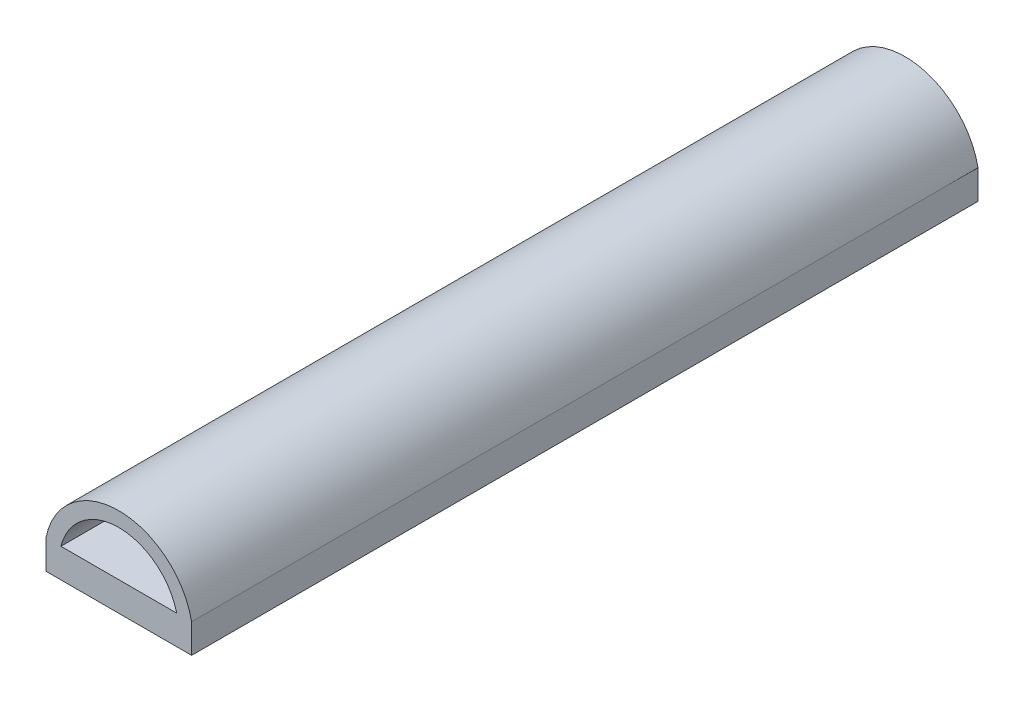
ISO-10303-21;
HEADER;
FILE_DESCRIPTION(('STEP AP214'),'2;1');
FILE_NAME('part.step','',(''),(''),'','','');
FILE_SCHEMA(('AUTOMOTIVE_DESIGN { 1 0 10303 214 1 1 1 1 }'));
ENDSEC;
DATA;
#1=APPLICATION_CONTEXT('core data for automotive mechanical design processes');
#2=APPLICATION_PROTOCOL_DEFINITION('international standard','automotive_design',2000,#1);
#3=PRODUCT_CONTEXT('',#1,'mechanical');
#4=PRODUCT('Part','Part','',(#3));
#5=PRODUCT_RELATED_PRODUCT_CATEGORY('part','',(#4));
#6=PRODUCT_DEFINITION_FORMATION('','',#4);
#7=PRODUCT_DEFINITION_CONTEXT('part definition',#1,'design');
#8=PRODUCT_DEFINITION('design','',#6,#7);
#9=PRODUCT_DEFINITION_SHAPE('','',#8);
#10=(LENGTH_UNIT() NAMED_UNIT(*) SI_UNIT(.MILLI.,.METRE.));
#11=(NAMED_UNIT(*) PLANE_ANGLE_UNIT() SI_UNIT($,.RADIAN.));
#12=(NAMED_UNIT(*) SI_UNIT($,.STERADIAN.) SOLID_ANGLE_UNIT());
#13=UNCERTAINTY_MEASURE_WITH_UNIT(LENGTH_MEASURE(1.E-05),#10,'distance_accuracy_value','');
#14=(GEOMETRIC_REPRESENTATION_CONTEXT(3) GLOBAL_UNCERTAINTY_ASSIGNED_CONTEXT((#13)) GLOBAL_UNIT_ASSIGNED_CONTEXT((#10,
#11,#12)) REPRESENTATION_CONTEXT('',''));
#15=CARTESIAN_POINT('',(0.,0.,0.));
#16=DIRECTION('',(0.,0.,1.));
#17=DIRECTION('',(1.,0.,0.));
#18=AXIS2_PLACEMENT_3D('',#15,#16,#17);
#19=CARTESIAN_POINT('',(-6.35,-1.28093723036239,68.58));
#20=DIRECTION('',(0.,1.,0.));
#21=DIRECTION('',(-1.,0.,0.));
#22=AXIS2_PLACEMENT_3D('',#19,#20,#21);
#23=PLANE('',#22);
#24=DIRECTION('',(0.,0.,-1.));
#25=VECTOR('',#24,1.);
#26=CARTESIAN_POINT('',(-0.508,-1.28093723036239,25.4));
#27=LINE('',#26,#25);
#28=CARTESIAN_POINT('',(-0.508,-1.28093723036239,25.4));
#29=VERTEX_POINT('',#28);
#30=CARTESIAN_POINT('',(-0.508,-1.28093723036239,0.));
#31=VERTEX_POINT('',#30);
#32=EDGE_CURVE('E153',#29,#31,#27,.T.);
#33=ORIENTED_EDGE('',*,*,#32,.F.);
#34=DIRECTION('',(1.,0.,0.));
#35=VECTOR('',#34,1.);
#36=CARTESIAN_POINT('',(0.508,-1.28093723036239,25.4));
#37=LINE('',#36,#35);
#38=CARTESIAN_POINT('',(0.508,-1.28093723036239,25.4));
#39=VERTEX_POINT('',#38);
#40=EDGE_CURVE('E145',#29,#39,#37,.T.);
#41=ORIENTED_EDGE('',*,*,#40,.T.);
#42=DIRECTION('',(0.,0.,-1.));
#43=VECTOR('',#42,1.);
#44=CARTESIAN_POINT('',(0.508,-1.28093723036239,25.4));
#45=LINE('',#44,#43);
#46=CARTESIAN_POINT('',(0.508,-1.28093723036239,0.));
#47=VERTEX_POINT('',#46);
#48=EDGE_CURVE('E131',#39,#47,#45,.T.);
#49=ORIENTED_EDGE('',*,*,#48,.T.);
#50=DIRECTION('',(1.,0.,0.));
#51=VECTOR('',#50,1.);
#52=CARTESIAN_POINT('',(-6.35,-1.28093723036239,0.));
#53=LINE('',#52,#51);
#54=CARTESIAN_POINT('',(6.35,-1.28093723036239,0.));
#55=VERTEX_POINT('',#54);
#56=EDGE_CURVE('E231',#47,#55,#53,.T.);
#57=ORIENTED_EDGE('',*,*,#56,.T.);
#58=DIRECTION('',(0.,0.,-1.));
#59=VECTOR('',#58,1.);
#60=CARTESIAN_POINT('',(6.35,-1.28093723036239,68.58));
#61=LINE('',#60,#59);
#62=CARTESIAN_POINT('',(6.35,-1.28093723036239,68.58));
#63=VERTEX_POINT('',#62);
#64=EDGE_CURVE('E237',#63,#55,#61,.T.);
#65=ORIENTED_EDGE('',*,*,#64,.F.);
#66=DIRECTION('',(1.,0.,0.));
#67=VECTOR('',#66,1.);
#68=CARTESIAN_POINT('',(-6.35,-1.28093723036239,68.58));
#69=LINE('',#68,#67);
#70=CARTESIAN_POINT('',(-6.35,-1.28093723036239,68.58));
#71=VERTEX_POINT('',#70);
#72=EDGE_CURVE('E222',#71,#63,#69,.T.);
#73=ORIENTED_EDGE('',*,*,#72,.F.);
#74=DIRECTION('',(0.,0.,-1.));
#75=VECTOR('',#74,1.);
#76=CARTESIAN_POINT('',(-6.35,-1.28093723036239,68.58));
#77=LINE('',#76,#75);
#78=CARTESIAN_POINT('',(-6.35,-1.28093723036239,0.));
#79=VERTEX_POINT('',#78);
#80=EDGE_CURVE('E40',#71,#79,#77,.T.);
#81=ORIENTED_EDGE('',*,*,#80,.T.);
#82=EDGE_CURVE('E232',#79,#31,#53,.T.);
#83=ORIENTED_EDGE('',*,*,#82,.T.);
#84=EDGE_LOOP('',(#33,#41,#49,#57,#65,#73,#81,#83));
#85=FACE_BOUND('',#84,.T.);
#86=ADVANCED_FACE('F32',(#85),#23,.F.);
#87=CARTESIAN_POINT('',(0.,0.,68.58));
#88=DIRECTION('',(0.,0.,-1.));
#89=DIRECTION('',(-1.,0.,0.));
#90=AXIS2_PLACEMENT_3D('',#87,#88,#89);
#91=PLANE('',#90);
#92=CARTESIAN_POINT('',(0.,0.,68.58));
#93=DIRECTION('',(0.,0.,1.));
#94=DIRECTION('',(-1.,0.,0.));
#95=AXIS2_PLACEMENT_3D('',#92,#93,#94);
#96=CIRCLE('',#95,6.47361869883356);
#97=CARTESIAN_POINT('',(6.35,1.25906276963761,68.58));
#98=VERTEX_POINT('',#97);
#99=CARTESIAN_POINT('',(-6.35,1.25906276963761,68.58));
#100=VERTEX_POINT('',#99);
#101=EDGE_CURVE('E216',#98,#100,#96,.T.);
#102=ORIENTED_EDGE('',*,*,#101,.T.);
#103=DIRECTION('',(0.,-1.,0.));
#104=VECTOR('',#103,1.);
#105=CARTESIAN_POINT('',(-6.35,1.25906276963761,68.58));
#106=LINE('',#105,#104);
#107=EDGE_CURVE('E219',#100,#71,#106,.T.);
#108=ORIENTED_EDGE('',*,*,#107,.T.);
#109=ORIENTED_EDGE('',*,*,#72,.T.);
#110=DIRECTION('',(0.,1.,0.));
#111=VECTOR('',#110,1.);
#112=CARTESIAN_POINT('',(6.35,-1.28093723036239,68.58));
#113=LINE('',#112,#111);
#114=EDGE_CURVE('E224',#63,#98,#113,.T.);
#115=ORIENTED_EDGE('',*,*,#114,.T.);
#116=EDGE_LOOP('',(#102,#108,#109,#115));
#117=FACE_BOUND('',#116,.T.);
#118=CARTESIAN_POINT('',(0.,0.,68.58));
#119=DIRECTION('',(0.,0.,1.));
#120=DIRECTION('',(-1.,0.,0.));
#121=AXIS2_PLACEMENT_3D('',#118,#119,#120);
#122=CIRCLE('',#121,5.20361869883356);
#123=CARTESIAN_POINT('',(5.04900074321274,1.25906276963761,68.58));
#124=VERTEX_POINT('',#123);
#125=CARTESIAN_POINT('',(-5.04900074321274,1.25906276963761,68.58));
#126=VERTEX_POINT('',#125);
#127=EDGE_CURVE('E202',#124,#126,#122,.T.);
#128=ORIENTED_EDGE('',*,*,#127,.F.);
#129=DIRECTION('',(1.,0.,0.));
#130=VECTOR('',#129,1.);
#131=CARTESIAN_POINT('',(-5.04900074321274,1.25906276963761,68.58));
#132=LINE('',#131,#130);
#133=EDGE_CURVE('E204',#126,#124,#132,.T.);
#134=ORIENTED_EDGE('',*,*,#133,.F.);
#135=EDGE_LOOP('',(#128,#134));
#136=FACE_BOUND('',#135,.T.);
#137=ADVANCED_FACE('F276',(#117,#136),#91,.F.);
#138=CARTESIAN_POINT('',(0.,0.,0.));
#139=DIRECTION('',(0.,0.,-1.));
#140=DIRECTION('',(-1.,0.,0.));
#141=AXIS2_PLACEMENT_3D('',#138,#139,#140);
#142=PLANE('',#141);
#143=CARTESIAN_POINT('',(0.,0.,0.));
#144=DIRECTION('',(0.,0.,1.));
#145=DIRECTION('',(-1.,0.,0.));
#146=AXIS2_PLACEMENT_3D('',#143,#144,#145);
#147=CIRCLE('',#146,6.47361869883356);
#148=CARTESIAN_POINT('',(6.35,1.25906276963761,0.));
#149=VERTEX_POINT('',#148);
#150=CARTESIAN_POINT('',(-6.35,1.25906276963761,0.));
#151=VERTEX_POINT('',#150);
#152=EDGE_CURVE('E215',#149,#151,#147,.T.);
#153=ORIENTED_EDGE('',*,*,#152,.F.);
#154=DIRECTION('',(0.,1.,0.));
#155=VECTOR('',#154,1.);
#156=CARTESIAN_POINT('',(6.35,-1.28093723036239,0.));
#157=LINE('',#156,#155);
#158=EDGE_CURVE('E220',#55,#149,#157,.T.);
#159=ORIENTED_EDGE('',*,*,#158,.F.);
#160=ORIENTED_EDGE('',*,*,#56,.F.);
#161=DIRECTION('',(0.,-1.,0.));
#162=VECTOR('',#161,1.);
#163=CARTESIAN_POINT('',(0.508,-3.37643723036239,0.));
#164=LINE('',#163,#162);
#165=CARTESIAN_POINT('',(0.508,-3.37643723036239,0.));
#166=VERTEX_POINT('',#165);
#167=EDGE_CURVE('E47',#47,#166,#164,.T.);
#168=ORIENTED_EDGE('',*,*,#167,.T.);
#169=DIRECTION('',(1.,0.,0.));
#170=VECTOR('',#169,1.);
#171=CARTESIAN_POINT('',(1.0795,-3.37643723036239,0.));
#172=LINE('',#171,#170);
#173=CARTESIAN_POINT('',(1.0795,-3.37643723036239,0.));
#174=VERTEX_POINT('',#173);
#175=EDGE_CURVE('E175',#166,#174,#172,.T.);
#176=ORIENTED_EDGE('',*,*,#175,.T.);
#177=DIRECTION('',(0.,-1.,0.));
#178=VECTOR('',#177,1.);
#179=CARTESIAN_POINT('',(1.0795,-4.26543723036239,0.));
#180=LINE('',#179,#178);
#181=CARTESIAN_POINT('',(1.0795,-4.26543723036239,0.));
#182=VERTEX_POINT('',#181);
#183=EDGE_CURVE('E178',#174,#182,#180,.T.);
#184=ORIENTED_EDGE('',*,*,#183,.T.);
#185=DIRECTION('',(-1.,0.,0.));
#186=VECTOR('',#185,1.);
#187=CARTESIAN_POINT('',(-1.0795,-4.26543723036239,0.));
#188=LINE('',#187,#186);
#189=CARTESIAN_POINT('',(-1.0795,-4.26543723036239,0.));
#190=VERTEX_POINT('',#189);
#191=EDGE_CURVE('E181',#182,#190,#188,.T.);
#192=ORIENTED_EDGE('',*,*,#191,.T.);
#193=DIRECTION('',(0.,1.,0.));
#194=VECTOR('',#193,1.);
#195=CARTESIAN_POINT('',(-1.0795,-3.37643723036239,0.));
#196=LINE('',#195,#194);
#197=CARTESIAN_POINT('',(-1.0795,-3.37643723036239,0.));
#198=VERTEX_POINT('',#197);
#199=EDGE_CURVE('E184',#190,#198,#196,.T.);
#200=ORIENTED_EDGE('',*,*,#199,.T.);
#201=DIRECTION('',(1.,0.,0.));
#202=VECTOR('',#201,1.);
#203=CARTESIAN_POINT('',(-0.508,-3.37643723036239,0.));
#204=LINE('',#203,#202);
#205=CARTESIAN_POINT('',(-0.508,-3.37643723036239,0.));
#206=VERTEX_POINT('',#205);
#207=EDGE_CURVE('E157',#198,#206,#204,.T.);
#208=ORIENTED_EDGE('',*,*,#207,.T.);
#209=DIRECTION('',(0.,1.,0.));
#210=VECTOR('',#209,1.);
#211=CARTESIAN_POINT('',(-0.508,-1.28093723036239,0.));
#212=LINE('',#211,#210);
#213=EDGE_CURVE('E154',#206,#31,#212,.T.);
#214=ORIENTED_EDGE('',*,*,#213,.T.);
#215=ORIENTED_EDGE('',*,*,#82,.F.);
#216=DIRECTION('',(0.,-1.,0.));
#217=VECTOR('',#216,1.);
#218=CARTESIAN_POINT('',(-6.35,1.25906276963761,0.));
#219=LINE('',#218,#217);
#220=EDGE_CURVE('E229',#151,#79,#219,.T.);
#221=ORIENTED_EDGE('',*,*,#220,.F.);
#222=EDGE_LOOP('',(#153,#159,#160,#168,#176,#184,#192,#200,#208,#214,#215,#221));
#223=FACE_BOUND('',#222,.T.);
#224=DIRECTION('',(1.,0.,0.));
#225=VECTOR('',#224,1.);
#226=CARTESIAN_POINT('',(-5.04900074321274,1.25906276963761,0.));
#227=LINE('',#226,#225);
#228=CARTESIAN_POINT('',(-5.04900074321274,1.25906276963761,0.));
#229=VERTEX_POINT('',#228);
#230=CARTESIAN_POINT('',(5.04900074321274,1.25906276963761,0.));
#231=VERTEX_POINT('',#230);
#232=EDGE_CURVE('E205',#229,#231,#227,.T.);
#233=ORIENTED_EDGE('',*,*,#232,.T.);
#234=CARTESIAN_POINT('',(0.,0.,0.));
#235=DIRECTION('',(0.,0.,1.));
#236=DIRECTION('',(-1.,0.,0.));
#237=AXIS2_PLACEMENT_3D('',#234,#235,#236);
#238=CIRCLE('',#237,5.20361869883356);
#239=EDGE_CURVE('E190',#231,#229,#238,.T.);
#240=ORIENTED_EDGE('',*,*,#239,.T.);
#241=EDGE_LOOP('',(#233,#240));
#242=FACE_BOUND('',#241,.T.);
#243=ADVANCED_FACE('F247',(#223,#242),#142,.T.);
#244=CARTESIAN_POINT('',(0.,0.,68.58));
#245=DIRECTION('',(0.,0.,-1.));
#246=DIRECTION('',(-1.,0.,0.));
#247=AXIS2_PLACEMENT_3D('',#244,#245,#246);
#248=CYLINDRICAL_SURFACE('',#247,6.47361869883356);
#249=ORIENTED_EDGE('',*,*,#152,.T.);
#250=DIRECTION('',(0.,0.,-1.));
#251=VECTOR('',#250,1.);
#252=CARTESIAN_POINT('',(-6.35,1.25906276963761,68.58));
#253=LINE('',#252,#251);
#254=EDGE_CURVE('E11',#100,#151,#253,.T.);
#255=ORIENTED_EDGE('',*,*,#254,.F.);
#256=ORIENTED_EDGE('',*,*,#101,.F.);
#257=DIRECTION('',(0.,0.,-1.));
#258=VECTOR('',#257,1.);
#259=CARTESIAN_POINT('',(6.35,1.25906276963761,68.58));
#260=LINE('',#259,#258);
#261=EDGE_CURVE('E226',#98,#149,#260,.T.);
#262=ORIENTED_EDGE('',*,*,#261,.T.);
#263=EDGE_LOOP('',(#249,#255,#256,#262));
#264=FACE_BOUND('',#263,.T.);
#265=ADVANCED_FACE('F34',(#264),#248,.T.);
#266=CARTESIAN_POINT('',(-6.35,1.25906276963761,68.58));
#267=DIRECTION('',(1.,0.,0.));
#268=DIRECTION('',(0.,0.,-1.));
#269=AXIS2_PLACEMENT_3D('',#266,#267,#268);
#270=PLANE('',#269);
#271=ORIENTED_EDGE('',*,*,#220,.T.);
#272=ORIENTED_EDGE('',*,*,#80,.F.);
#273=ORIENTED_EDGE('',*,*,#107,.F.);
#274=ORIENTED_EDGE('',*,*,#254,.T.);
#275=EDGE_LOOP('',(#271,#272,#273,#274));
#276=FACE_BOUND('',#275,.T.);
#277=ADVANCED_FACE('F279',(#276),#270,.F.);
#278=CARTESIAN_POINT('',(6.35,-1.28093723036239,68.58));
#279=DIRECTION('',(-1.,0.,0.));
#280=DIRECTION('',(0.,0.,1.));
#281=AXIS2_PLACEMENT_3D('',#278,#279,#280);
#282=PLANE('',#281);
#283=ORIENTED_EDGE('',*,*,#158,.T.);
#284=ORIENTED_EDGE('',*,*,#261,.F.);
#285=ORIENTED_EDGE('',*,*,#114,.F.);
#286=ORIENTED_EDGE('',*,*,#64,.T.);
#287=EDGE_LOOP('',(#283,#284,#285,#286));
#288=FACE_BOUND('',#287,.T.);
#289=ADVANCED_FACE('F272',(#288),#282,.F.);
#290=CARTESIAN_POINT('',(0.,0.,68.58));
#291=DIRECTION('',(0.,0.,-1.));
#292=DIRECTION('',(-1.,0.,0.));
#293=AXIS2_PLACEMENT_3D('',#290,#291,#292);
#294=CYLINDRICAL_SURFACE('',#293,5.20361869883356);
#295=ORIENTED_EDGE('',*,*,#239,.F.);
#296=DIRECTION('',(0.,0.,-1.));
#297=VECTOR('',#296,1.);
#298=CARTESIAN_POINT('',(5.04900074321274,1.25906276963761,68.58));
#299=LINE('',#298,#297);
#300=EDGE_CURVE('E207',#124,#231,#299,.T.);
#301=ORIENTED_EDGE('',*,*,#300,.F.);
#302=ORIENTED_EDGE('',*,*,#127,.T.);
#303=DIRECTION('',(0.,0.,-1.));
#304=VECTOR('',#303,1.);
#305=CARTESIAN_POINT('',(-5.04900074321274,1.25906276963761,68.58));
#306=LINE('',#305,#304);
#307=EDGE_CURVE('E55',#126,#229,#306,.T.);
#308=ORIENTED_EDGE('',*,*,#307,.T.);
#309=EDGE_LOOP('',(#295,#301,#302,#308));
#310=FACE_BOUND('',#309,.T.);
#311=ADVANCED_FACE('F295',(#310),#294,.F.);
#312=CARTESIAN_POINT('',(-5.04900074321274,1.25906276963761,68.58));
#313=DIRECTION('',(0.,1.,0.));
#314=DIRECTION('',(0.,0.,1.));
#315=AXIS2_PLACEMENT_3D('',#312,#313,#314);
#316=PLANE('',#315);
#317=ORIENTED_EDGE('',*,*,#232,.F.);
#318=ORIENTED_EDGE('',*,*,#307,.F.);
#319=ORIENTED_EDGE('',*,*,#133,.T.);
#320=ORIENTED_EDGE('',*,*,#300,.T.);
#321=EDGE_LOOP('',(#317,#318,#319,#320));
#322=FACE_BOUND('',#321,.T.);
#323=ADVANCED_FACE('F299',(#322),#316,.T.);
#324=CARTESIAN_POINT('',(-0.508,-1.28093723036239,25.4));
#325=DIRECTION('',(-1.,0.,0.));
#326=DIRECTION('',(0.,-1.,0.));
#327=AXIS2_PLACEMENT_3D('',#324,#325,#326);
#328=PLANE('',#327);
#329=ORIENTED_EDGE('',*,*,#213,.F.);
#330=DIRECTION('',(0.,0.,-1.));
#331=VECTOR('',#330,1.);
#332=CARTESIAN_POINT('',(-0.508,-3.37643723036239,25.4));
#333=LINE('',#332,#331);
#334=CARTESIAN_POINT('',(-0.508,-3.37643723036239,25.4));
#335=VERTEX_POINT('',#334);
#336=EDGE_CURVE('E191',#335,#206,#333,.T.);
#337=ORIENTED_EDGE('',*,*,#336,.F.);
#338=DIRECTION('',(0.,1.,0.));
#339=VECTOR('',#338,1.);
#340=CARTESIAN_POINT('',(-0.508,-1.28093723036239,25.4));
#341=LINE('',#340,#339);
#342=EDGE_CURVE('E139',#335,#29,#341,.T.);
#343=ORIENTED_EDGE('',*,*,#342,.T.);
#344=ORIENTED_EDGE('',*,*,#32,.T.);
#345=EDGE_LOOP('',(#329,#337,#343,#344));
#346=FACE_BOUND('',#345,.T.);
#347=ADVANCED_FACE('F252',(#346),#328,.T.);
#348=CARTESIAN_POINT('',(-0.508,-3.37643723036239,25.4));
#349=DIRECTION('',(0.,1.,0.));
#350=DIRECTION('',(0.,0.,1.));
#351=AXIS2_PLACEMENT_3D('',#348,#349,#350);
#352=PLANE('',#351);
#353=ORIENTED_EDGE('',*,*,#207,.F.);
#354=DIRECTION('',(0.,0.,-1.));
#355=VECTOR('',#354,1.);
#356=CARTESIAN_POINT('',(-1.0795,-3.37643723036239,25.4));
#357=LINE('',#356,#355);
#358=CARTESIAN_POINT('',(-1.0795,-3.37643723036239,25.4));
#359=VERTEX_POINT('',#358);
#360=EDGE_CURVE('E193',#359,#198,#357,.T.);
#361=ORIENTED_EDGE('',*,*,#360,.F.);
#362=DIRECTION('',(1.,0.,0.));
#363=VECTOR('',#362,1.);
#364=CARTESIAN_POINT('',(-0.508,-3.37643723036239,25.4));
#365=LINE('',#364,#363);
#366=EDGE_CURVE('E170',#359,#335,#365,.T.);
#367=ORIENTED_EDGE('',*,*,#366,.T.);
#368=ORIENTED_EDGE('',*,*,#336,.T.);
#369=EDGE_LOOP('',(#353,#361,#367,#368));
#370=FACE_BOUND('',#369,.T.);
#371=ADVANCED_FACE('F313',(#370),#352,.T.);
#372=CARTESIAN_POINT('',(-1.0795,-3.37643723036239,25.4));
#373=DIRECTION('',(-1.,0.,0.));
#374=DIRECTION('',(0.,-1.,0.));
#375=AXIS2_PLACEMENT_3D('',#372,#373,#374);
#376=PLANE('',#375);
#377=ORIENTED_EDGE('',*,*,#199,.F.);
#378=DIRECTION('',(0.,0.,-1.));
#379=VECTOR('',#378,1.);
#380=CARTESIAN_POINT('',(-1.0795,-4.26543723036239,25.4));
#381=LINE('',#380,#379);
#382=CARTESIAN_POINT('',(-1.0795,-4.26543723036239,25.4));
#383=VERTEX_POINT('',#382);
#384=EDGE_CURVE('E195',#383,#190,#381,.T.);
#385=ORIENTED_EDGE('',*,*,#384,.F.);
#386=DIRECTION('',(0.,1.,0.));
#387=VECTOR('',#386,1.);
#388=CARTESIAN_POINT('',(-1.0795,-3.37643723036239,25.4));
#389=LINE('',#388,#387);
#390=EDGE_CURVE('E167',#383,#359,#389,.T.);
#391=ORIENTED_EDGE('',*,*,#390,.T.);
#392=ORIENTED_EDGE('',*,*,#360,.T.);
#393=EDGE_LOOP('',(#377,#385,#391,#392));
#394=FACE_BOUND('',#393,.T.);
#395=ADVANCED_FACE('F259',(#394),#376,.T.);
#396=CARTESIAN_POINT('',(-1.0795,-4.26543723036239,25.4));
#397=DIRECTION('',(0.,-1.,0.));
#398=DIRECTION('',(0.,0.,-1.));
#399=AXIS2_PLACEMENT_3D('',#396,#397,#398);
#400=PLANE('',#399);
#401=ORIENTED_EDGE('',*,*,#191,.F.);
#402=DIRECTION('',(0.,0.,-1.));
#403=VECTOR('',#402,1.);
#404=CARTESIAN_POINT('',(1.0795,-4.26543723036239,25.4));
#405=LINE('',#404,#403);
#406=CARTESIAN_POINT('',(1.0795,-4.26543723036239,25.4));
#407=VERTEX_POINT('',#406);
#408=EDGE_CURVE('E197',#407,#182,#405,.T.);
#409=ORIENTED_EDGE('',*,*,#408,.F.);
#410=DIRECTION('',(-1.,0.,0.));
#411=VECTOR('',#410,1.);
#412=CARTESIAN_POINT('',(-1.0795,-4.26543723036239,25.4));
#413=LINE('',#412,#411);
#414=EDGE_CURVE('E164',#407,#383,#413,.T.);
#415=ORIENTED_EDGE('',*,*,#414,.T.);
#416=ORIENTED_EDGE('',*,*,#384,.T.);
#417=EDGE_LOOP('',(#401,#409,#415,#416));
#418=FACE_BOUND('',#417,.T.);
#419=ADVANCED_FACE('F262',(#418),#400,.T.);
#420=CARTESIAN_POINT('',(1.0795,-4.26543723036239,25.4));
#421=DIRECTION('',(1.,0.,0.));
#422=DIRECTION('',(0.,1.,0.));
#423=AXIS2_PLACEMENT_3D('',#420,#421,#422);
#424=PLANE('',#423);
#425=ORIENTED_EDGE('',*,*,#183,.F.);
#426=DIRECTION('',(0.,0.,-1.));
#427=VECTOR('',#426,1.);
#428=CARTESIAN_POINT('',(1.0795,-3.37643723036239,25.4));
#429=LINE('',#428,#427);
#430=CARTESIAN_POINT('',(1.0795,-3.37643723036239,25.4));
#431=VERTEX_POINT('',#430);
#432=EDGE_CURVE('E199',#431,#174,#429,.T.);
#433=ORIENTED_EDGE('',*,*,#432,.F.);
#434=DIRECTION('',(0.,-1.,0.));
#435=VECTOR('',#434,1.);
#436=CARTESIAN_POINT('',(1.0795,-4.26543723036239,25.4));
#437=LINE('',#436,#435);
#438=EDGE_CURVE('E161',#431,#407,#437,.T.);
#439=ORIENTED_EDGE('',*,*,#438,.T.);
#440=ORIENTED_EDGE('',*,*,#408,.T.);
#441=EDGE_LOOP('',(#425,#433,#439,#440));
#442=FACE_BOUND('',#441,.T.);
#443=ADVANCED_FACE('F265',(#442),#424,.T.);
#444=CARTESIAN_POINT('',(1.0795,-3.37643723036239,25.4));
#445=DIRECTION('',(0.,1.,0.));
#446=DIRECTION('',(0.,0.,1.));
#447=AXIS2_PLACEMENT_3D('',#444,#445,#446);
#448=PLANE('',#447);
#449=ORIENTED_EDGE('',*,*,#175,.F.);
#450=DIRECTION('',(0.,0.,-1.));
#451=VECTOR('',#450,1.);
#452=CARTESIAN_POINT('',(0.508,-3.37643723036239,25.4));
#453=LINE('',#452,#451);
#454=CARTESIAN_POINT('',(0.508,-3.37643723036239,25.4));
#455=VERTEX_POINT('',#454);
#456=EDGE_CURVE('E138',#455,#166,#453,.T.);
#457=ORIENTED_EDGE('',*,*,#456,.F.);
#458=DIRECTION('',(1.,0.,0.));
#459=VECTOR('',#458,1.);
#460=CARTESIAN_POINT('',(1.0795,-3.37643723036239,25.4));
#461=LINE('',#460,#459);
#462=EDGE_CURVE('E149',#455,#431,#461,.T.);
#463=ORIENTED_EDGE('',*,*,#462,.T.);
#464=ORIENTED_EDGE('',*,*,#432,.T.);
#465=EDGE_LOOP('',(#449,#457,#463,#464));
#466=FACE_BOUND('',#465,.T.);
#467=ADVANCED_FACE('F268',(#466),#448,.T.);
#468=CARTESIAN_POINT('',(0.508,-3.37643723036239,25.4));
#469=DIRECTION('',(1.,0.,0.));
#470=DIRECTION('',(0.,1.,0.));
#471=AXIS2_PLACEMENT_3D('',#468,#469,#470);
#472=PLANE('',#471);
#473=ORIENTED_EDGE('',*,*,#167,.F.);
#474=ORIENTED_EDGE('',*,*,#48,.F.);
#475=DIRECTION('',(0.,-1.,0.));
#476=VECTOR('',#475,1.);
#477=CARTESIAN_POINT('',(0.508,-3.37643723036239,25.4));
#478=LINE('',#477,#476);
#479=EDGE_CURVE('E134',#39,#455,#478,.T.);
#480=ORIENTED_EDGE('',*,*,#479,.T.);
#481=ORIENTED_EDGE('',*,*,#456,.T.);
#482=EDGE_LOOP('',(#473,#474,#480,#481));
#483=FACE_BOUND('',#482,.T.);
#484=ADVANCED_FACE('F133',(#483),#472,.T.);
#485=CARTESIAN_POINT('',(0.,0.,25.4));
#486=DIRECTION('',(0.,0.,1.));
#487=DIRECTION('',(1.,0.,0.));
#488=AXIS2_PLACEMENT_3D('',#485,#486,#487);
#489=PLANE('',#488);
#490=ORIENTED_EDGE('',*,*,#40,.F.);
#491=ORIENTED_EDGE('',*,*,#342,.F.);
#492=ORIENTED_EDGE('',*,*,#366,.F.);
#493=ORIENTED_EDGE('',*,*,#390,.F.);
#494=ORIENTED_EDGE('',*,*,#414,.F.);
#495=ORIENTED_EDGE('',*,*,#438,.F.);
#496=ORIENTED_EDGE('',*,*,#462,.F.);
#497=ORIENTED_EDGE('',*,*,#479,.F.);
#498=EDGE_LOOP('',(#490,#491,#492,#493,#494,#495,#496,#497));
#499=FACE_BOUND('',#498,.T.);
#500=ADVANCED_FACE('F143',(#499),#489,.T.);
#501=CLOSED_SHELL('',(#86,#137,#243,#265,#277,#289,#311,#323,#347,#371,#395,#419,#443,#467,#484,#500));
#502=MANIFOLD_SOLID_BREP('B2',#501);
#503=ADVANCED_BREP_SHAPE_REPRESENTATION('',(#18,#502),#14);
#504=SHAPE_DEFINITION_REPRESENTATION(#9,#503);
ENDSEC;
END-ISO-10303-21;
